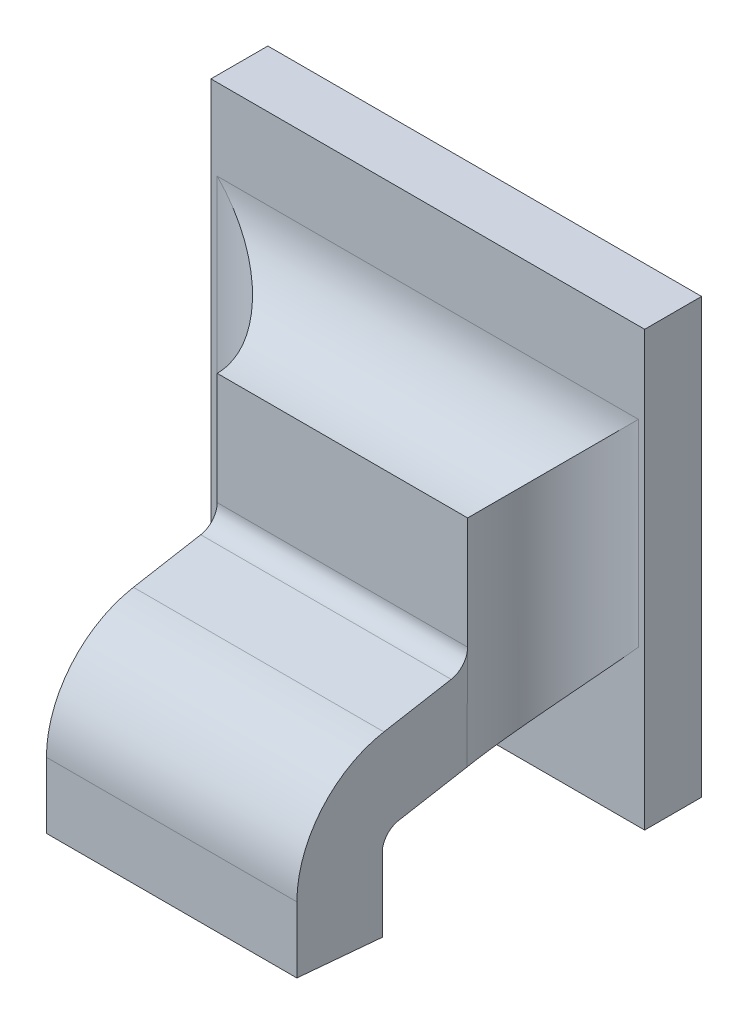
ISO-10303-21;
HEADER;
FILE_DESCRIPTION(('STEP AP214'),'2;1');
FILE_NAME('part.step','',(''),(''),'','','');
FILE_SCHEMA(('AUTOMOTIVE_DESIGN { 1 0 10303 214 1 1 1 1 }'));
ENDSEC;
DATA;
#1=APPLICATION_CONTEXT('core data for automotive mechanical design processes');
#2=APPLICATION_PROTOCOL_DEFINITION('international standard','automotive_design',2000,#1);
#3=PRODUCT_CONTEXT('',#1,'mechanical');
#4=PRODUCT('Part','Part','',(#3));
#5=PRODUCT_RELATED_PRODUCT_CATEGORY('part','',(#4));
#6=PRODUCT_DEFINITION_FORMATION('','',#4);
#7=PRODUCT_DEFINITION_CONTEXT('part definition',#1,'design');
#8=PRODUCT_DEFINITION('design','',#6,#7);
#9=PRODUCT_DEFINITION_SHAPE('','',#8);
#10=(LENGTH_UNIT() NAMED_UNIT(*) SI_UNIT(.MILLI.,.METRE.));
#11=(NAMED_UNIT(*) PLANE_ANGLE_UNIT() SI_UNIT($,.RADIAN.));
#12=(NAMED_UNIT(*) SI_UNIT($,.STERADIAN.) SOLID_ANGLE_UNIT());
#13=UNCERTAINTY_MEASURE_WITH_UNIT(LENGTH_MEASURE(1.E-05),#10,'distance_accuracy_value','');
#14=(GEOMETRIC_REPRESENTATION_CONTEXT(3) GLOBAL_UNCERTAINTY_ASSIGNED_CONTEXT((#13)) GLOBAL_UNIT_ASSIGNED_CONTEXT((#10,
#11,#12)) REPRESENTATION_CONTEXT('',''));
#15=CARTESIAN_POINT('',(0.,0.,0.));
#16=DIRECTION('',(0.,0.,1.));
#17=DIRECTION('',(1.,0.,0.));
#18=AXIS2_PLACEMENT_3D('',#15,#16,#17);
#19=CARTESIAN_POINT('',(-0.558543209453366,-0.409030625475599,0.0757120583538573));
#20=DIRECTION('',(0.,0.984807753012208,0.17364817766693));
#21=DIRECTION('',(0.,-0.17364817766693,0.984807753012208));
#22=AXIS2_PLACEMENT_3D('',#19,#20,#21);
#23=PLANE('',#22);
#24=DIRECTION('',(0.,-0.1736481776669,0.984807753012213));
#25=VECTOR('',#24,1.);
#26=CARTESIAN_POINT('',(-0.540354233075413,-0.40907165363979,0.0759447406355241));
#27=LINE('',#26,#25);
#28=CARTESIAN_POINT('',(-0.540354233075413,-0.40907165363979,0.0759447406355241));
#29=VERTEX_POINT('',#28);
#30=CARTESIAN_POINT('',(-0.540354233075413,-0.409892216923603,0.0805983862688596));
#31=VERTEX_POINT('',#30);
#32=EDGE_CURVE('E149',#29,#31,#27,.T.);
#33=ORIENTED_EDGE('',*,*,#32,.F.);
#34=DIRECTION('',(1.,0.,0.));
#35=VECTOR('',#34,1.);
#36=CARTESIAN_POINT('',(-0.53948809134313,-0.409071653639789,0.0759447406355242));
#37=LINE('',#36,#35);
#38=CARTESIAN_POINT('',(-0.557677067721083,-0.40907165363979,0.0759447406355241));
#39=VERTEX_POINT('',#38);
#40=EDGE_CURVE('E145',#29,#39,#37,.F.);
#41=ORIENTED_EDGE('',*,*,#40,.T.);
#42=DIRECTION('',(0.,-0.1736481776669,0.984807753012213));
#43=VECTOR('',#42,1.);
#44=CARTESIAN_POINT('',(-0.557677067721083,-0.40907165363979,0.0759447406355241));
#45=LINE('',#44,#43);
#46=CARTESIAN_POINT('',(-0.557677067721083,-0.409892216923603,0.0805983862688596));
#47=VERTEX_POINT('',#46);
#48=EDGE_CURVE('E187',#39,#47,#45,.T.);
#49=ORIENTED_EDGE('',*,*,#48,.T.);
#50=DIRECTION('',(1.,0.,0.));
#51=VECTOR('',#50,1.);
#52=CARTESIAN_POINT('',(-0.53948809134313,-0.409892216923603,0.0805983862688598));
#53=LINE('',#52,#51);
#54=EDGE_CURVE('E228',#31,#47,#53,.F.);
#55=ORIENTED_EDGE('',*,*,#54,.F.);
#56=EDGE_LOOP('',(#33,#41,#49,#55));
#57=FACE_BOUND('',#56,.T.);
#58=ADVANCED_FACE('F17',(#57),#23,.T.);
#59=CARTESIAN_POINT('',(-0.53948809134313,-0.417065029297904,0.0793336259197108));
#60=DIRECTION('',(1.,0.,0.));
#61=DIRECTION('',(0.,1.,0.));
#62=AXIS2_PLACEMENT_3D('',#59,#60,#61);
#63=CYLINDRICAL_SURFACE('',#62,0.00728346456692914);
#64=CARTESIAN_POINT('',(-0.540354233075413,-0.417065029297904,0.0793336259197108));
#65=DIRECTION('',(1.,0.,0.));
#66=DIRECTION('',(0.,1.,0.));
#67=AXIS2_PLACEMENT_3D('',#64,#65,#66);
#68=CIRCLE('',#67,0.00728346456692914);
#69=CARTESIAN_POINT('',(-0.540354233075413,-0.417065029297904,0.0866170904866399));
#70=VERTEX_POINT('',#69);
#71=EDGE_CURVE('E202',#31,#70,#68,.T.);
#72=ORIENTED_EDGE('',*,*,#71,.F.);
#73=ORIENTED_EDGE('',*,*,#54,.T.);
#74=CARTESIAN_POINT('',(-0.557677067721083,-0.417065029297904,0.0793336259197108));
#75=DIRECTION('',(1.,0.,0.));
#76=DIRECTION('',(0.,1.,0.));
#77=AXIS2_PLACEMENT_3D('',#74,#75,#76);
#78=CIRCLE('',#77,0.00728346456692914);
#79=CARTESIAN_POINT('',(-0.557677067721083,-0.417065029297904,0.0866170904866399));
#80=VERTEX_POINT('',#79);
#81=EDGE_CURVE('E184',#47,#80,#78,.T.);
#82=ORIENTED_EDGE('',*,*,#81,.T.);
#83=DIRECTION('',(1.,0.,0.));
#84=VECTOR('',#83,1.);
#85=CARTESIAN_POINT('',(-0.558543209453366,-0.417065029297904,0.0866170904866399));
#86=LINE('',#85,#84);
#87=EDGE_CURVE('E224',#70,#80,#86,.F.);
#88=ORIENTED_EDGE('',*,*,#87,.F.);
#89=EDGE_LOOP('',(#72,#73,#82,#88));
#90=FACE_BOUND('',#89,.T.);
#91=ADVANCED_FACE('F278',(#90),#63,.T.);
#92=CARTESIAN_POINT('',(-0.558543209453366,-0.416837019770818,0.0866170904866399));
#93=DIRECTION('',(0.,0.,1.));
#94=DIRECTION('',(0.,-1.,0.));
#95=AXIS2_PLACEMENT_3D('',#92,#93,#94);
#96=PLANE('',#95);
#97=ORIENTED_EDGE('',*,*,#87,.T.);
#98=DIRECTION('',(0.,1.,0.));
#99=VECTOR('',#98,1.);
#100=CARTESIAN_POINT('',(-0.557677067721083,-0.422863247680058,0.0866170904866399));
#101=LINE('',#100,#99);
#102=CARTESIAN_POINT('',(-0.557677067721083,-0.421625219839629,0.0866170904866399));
#103=VERTEX_POINT('',#102);
#104=EDGE_CURVE('E181',#80,#103,#101,.F.);
#105=ORIENTED_EDGE('',*,*,#104,.T.);
#106=DIRECTION('',(1.,0.,0.));
#107=VECTOR('',#106,1.);
#108=CARTESIAN_POINT('',(-0.549015650398248,-0.421625219839629,0.0866170904866399));
#109=LINE('',#108,#107);
#110=CARTESIAN_POINT('',(-0.540354233075413,-0.421625219839629,0.0866170904866399));
#111=VERTEX_POINT('',#110);
#112=EDGE_CURVE('E215',#103,#111,#109,.T.);
#113=ORIENTED_EDGE('',*,*,#112,.T.);
#114=DIRECTION('',(0.,1.,0.));
#115=VECTOR('',#114,1.);
#116=CARTESIAN_POINT('',(-0.540354233075413,-0.422863247680058,0.0866170904866399));
#117=LINE('',#116,#115);
#118=EDGE_CURVE('E200',#70,#111,#117,.F.);
#119=ORIENTED_EDGE('',*,*,#118,.F.);
#120=EDGE_LOOP('',(#97,#105,#113,#119));
#121=FACE_BOUND('',#120,.T.);
#122=ADVANCED_FACE('F282',(#121),#96,.T.);
#123=CARTESIAN_POINT('',(-0.549015650398248,-0.421657307598093,0.0862503257291207));
#124=DIRECTION('',(0.,0.99619469809174,-0.0871557427477276));
#125=DIRECTION('',(0.,0.0871557427477276,0.99619469809174));
#126=AXIS2_PLACEMENT_3D('',#123,#124,#125);
#127=PLANE('',#126);
#128=DIRECTION('',(0.,-0.0871557427476629,-0.996194698091745));
#129=VECTOR('',#128,1.);
#130=CARTESIAN_POINT('',(-0.540354233075413,-0.421625219839629,0.0866170904866399));
#131=LINE('',#130,#129);
#132=CARTESIAN_POINT('',(-0.540354233075413,-0.422141885175412,0.0807115786756163));
#133=VERTEX_POINT('',#132);
#134=EDGE_CURVE('E197',#111,#133,#131,.T.);
#135=ORIENTED_EDGE('',*,*,#134,.F.);
#136=ORIENTED_EDGE('',*,*,#112,.F.);
#137=DIRECTION('',(0.,-0.0871557427476629,-0.996194698091745));
#138=VECTOR('',#137,1.);
#139=CARTESIAN_POINT('',(-0.557677067721083,-0.421625219839629,0.0866170904866399));
#140=LINE('',#139,#138);
#141=CARTESIAN_POINT('',(-0.557677067721083,-0.422141885175412,0.0807115786756163));
#142=VERTEX_POINT('',#141);
#143=EDGE_CURVE('E178',#103,#142,#140,.T.);
#144=ORIENTED_EDGE('',*,*,#143,.T.);
#145=DIRECTION('',(1.,0.,0.));
#146=VECTOR('',#145,1.);
#147=CARTESIAN_POINT('',(-0.558543209453366,-0.422141885175412,0.0807115786756163));
#148=LINE('',#147,#146);
#149=EDGE_CURVE('E212',#142,#133,#148,.T.);
#150=ORIENTED_EDGE('',*,*,#149,.T.);
#151=EDGE_LOOP('',(#135,#136,#144,#150));
#152=FACE_BOUND('',#151,.T.);
#153=ADVANCED_FACE('F286',(#152),#127,.F.);
#154=CARTESIAN_POINT('',(-0.558543209453366,-0.416811186504029,0.0807115786756163));
#155=DIRECTION('',(0.,0.,1.));
#156=DIRECTION('',(0.,-1.,0.));
#157=AXIS2_PLACEMENT_3D('',#154,#155,#156);
#158=PLANE('',#157);
#159=ORIENTED_EDGE('',*,*,#149,.F.);
#160=DIRECTION('',(0.,1.,0.));
#161=VECTOR('',#160,1.);
#162=CARTESIAN_POINT('',(-0.557677067721083,-0.422863247680058,0.0807115786756163));
#163=LINE('',#162,#161);
#164=CARTESIAN_POINT('',(-0.557677067721083,-0.417065029297904,0.0807115786756163));
#165=VERTEX_POINT('',#164);
#166=EDGE_CURVE('E175',#142,#165,#163,.T.);
#167=ORIENTED_EDGE('',*,*,#166,.T.);
#168=DIRECTION('',(1.,0.,0.));
#169=VECTOR('',#168,1.);
#170=CARTESIAN_POINT('',(-0.53948809134313,-0.417065029297904,0.0807115786756163));
#171=LINE('',#170,#169);
#172=CARTESIAN_POINT('',(-0.540354233075413,-0.417065029297904,0.0807115786756163));
#173=VERTEX_POINT('',#172);
#174=EDGE_CURVE('E207',#165,#173,#171,.T.);
#175=ORIENTED_EDGE('',*,*,#174,.T.);
#176=DIRECTION('',(0.,1.,0.));
#177=VECTOR('',#176,1.);
#178=CARTESIAN_POINT('',(-0.540354233075413,-0.422863247680058,0.0807115786756163));
#179=LINE('',#178,#177);
#180=EDGE_CURVE('E194',#133,#173,#179,.T.);
#181=ORIENTED_EDGE('',*,*,#180,.F.);
#182=EDGE_LOOP('',(#159,#167,#175,#181));
#183=FACE_BOUND('',#182,.T.);
#184=ADVANCED_FACE('F290',(#183),#158,.F.);
#185=CARTESIAN_POINT('',(-0.53948809134313,-0.417065029297904,0.0793336259197108));
#186=DIRECTION('',(1.,0.,0.));
#187=DIRECTION('',(0.,1.,0.));
#188=AXIS2_PLACEMENT_3D('',#185,#186,#187);
#189=CYLINDRICAL_SURFACE('',#188,0.00137795275590551);
#190=DIRECTION('',(1.,0.,0.));
#191=VECTOR('',#190,1.);
#192=CARTESIAN_POINT('',(-0.558543209453366,-0.415708010740604,0.0795729049046849));
#193=LINE('',#192,#191);
#194=CARTESIAN_POINT('',(-0.557677067721083,-0.415708010740604,0.0795729049046849));
#195=VERTEX_POINT('',#194);
#196=CARTESIAN_POINT('',(-0.540354233075413,-0.415708010740604,0.0795729049046849));
#197=VERTEX_POINT('',#196);
#198=EDGE_CURVE('E191',#195,#197,#193,.T.);
#199=ORIENTED_EDGE('',*,*,#198,.T.);
#200=CARTESIAN_POINT('',(-0.540354233075413,-0.417065029297904,0.0793336259197108));
#201=DIRECTION('',(1.,0.,0.));
#202=DIRECTION('',(0.,1.,0.));
#203=AXIS2_PLACEMENT_3D('',#200,#201,#202);
#204=CIRCLE('',#203,0.00137795275590551);
#205=EDGE_CURVE('E196',#173,#197,#204,.F.);
#206=ORIENTED_EDGE('',*,*,#205,.F.);
#207=ORIENTED_EDGE('',*,*,#174,.F.);
#208=CARTESIAN_POINT('',(-0.557677067721083,-0.417065029297904,0.0793336259197108));
#209=DIRECTION('',(1.,0.,0.));
#210=DIRECTION('',(0.,1.,0.));
#211=AXIS2_PLACEMENT_3D('',#208,#209,#210);
#212=CIRCLE('',#211,0.00137795275590551);
#213=EDGE_CURVE('E172',#165,#195,#212,.F.);
#214=ORIENTED_EDGE('',*,*,#213,.T.);
#215=EDGE_LOOP('',(#199,#206,#207,#214));
#216=FACE_BOUND('',#215,.T.);
#217=ADVANCED_FACE('F294',(#216),#189,.F.);
#218=CARTESIAN_POINT('',(-0.53948809134313,-0.407714635082489,0.0761840196204982));
#219=DIRECTION('',(1.,0.,0.));
#220=DIRECTION('',(0.,1.,0.));
#221=AXIS2_PLACEMENT_3D('',#218,#219,#220);
#222=CYLINDRICAL_SURFACE('',#221,0.00137795275590552);
#223=ORIENTED_EDGE('',*,*,#40,.F.);
#224=CARTESIAN_POINT('',(-0.540354233075413,-0.407714635082489,0.0761840196204982));
#225=DIRECTION('',(1.,0.,0.));
#226=DIRECTION('',(0.,1.,0.));
#227=AXIS2_PLACEMENT_3D('',#224,#225,#226);
#228=CIRCLE('',#227,0.00137795275590552);
#229=CARTESIAN_POINT('',(-0.540354233075413,-0.407714635082489,0.0748060668645927));
#230=VERTEX_POINT('',#229);
#231=EDGE_CURVE('E20',#230,#29,#228,.F.);
#232=ORIENTED_EDGE('',*,*,#231,.F.);
#233=DIRECTION('',(1.,0.,0.));
#234=VECTOR('',#233,1.);
#235=CARTESIAN_POINT('',(-0.558543209453366,-0.407714635082489,0.0748060668645927));
#236=LINE('',#235,#234);
#237=CARTESIAN_POINT('',(-0.557677067721083,-0.407714635082489,0.0748060668645927));
#238=VERTEX_POINT('',#237);
#239=EDGE_CURVE('E127',#238,#230,#236,.T.);
#240=ORIENTED_EDGE('',*,*,#239,.F.);
#241=CARTESIAN_POINT('',(-0.557677067721083,-0.407714635082489,0.0761840196204982));
#242=DIRECTION('',(1.,0.,0.));
#243=DIRECTION('',(0.,1.,0.));
#244=AXIS2_PLACEMENT_3D('',#241,#242,#243);
#245=CIRCLE('',#244,0.00137795275590552);
#246=EDGE_CURVE('E139',#238,#39,#245,.F.);
#247=ORIENTED_EDGE('',*,*,#246,.T.);
#248=EDGE_LOOP('',(#223,#232,#240,#247));
#249=FACE_BOUND('',#248,.T.);
#250=ADVANCED_FACE('F143',(#249),#222,.F.);
#251=CARTESIAN_POINT('',(-0.540354233075413,-0.422863247680058,0.0742155156834903));
#252=DIRECTION('',(1.,0.,0.));
#253=DIRECTION('',(0.,1.,0.));
#254=AXIS2_PLACEMENT_3D('',#251,#252,#253);
#255=PLANE('',#254);
#256=ORIENTED_EDGE('',*,*,#205,.T.);
#257=DIRECTION('',(0.,-0.17364817766693,0.984807753012208));
#258=VECTOR('',#257,1.);
#259=CARTESIAN_POINT('',(-0.540354233075413,-0.4148464192926,0.0746865769896825));
#260=LINE('',#259,#258);
#261=CARTESIAN_POINT('',(-0.540354233075413,-0.414877006254794,0.074862663067971));
#262=VERTEX_POINT('',#261);
#263=EDGE_CURVE('E162',#197,#262,#260,.F.);
#264=ORIENTED_EDGE('',*,*,#263,.T.);
#265=DIRECTION('',(0.,1.,0.));
#266=VECTOR('',#265,1.);
#267=CARTESIAN_POINT('',(-0.540354233075414,-0.393026144704955,0.0748060668645927));
#268=LINE('',#267,#266);
#269=EDGE_CURVE('E138',#262,#230,#268,.T.);
#270=ORIENTED_EDGE('',*,*,#269,.T.);
#271=ORIENTED_EDGE('',*,*,#231,.T.);
#272=ORIENTED_EDGE('',*,*,#32,.T.);
#273=ORIENTED_EDGE('',*,*,#71,.T.);
#274=ORIENTED_EDGE('',*,*,#118,.T.);
#275=ORIENTED_EDGE('',*,*,#134,.T.);
#276=ORIENTED_EDGE('',*,*,#180,.T.);
#277=EDGE_LOOP('',(#256,#264,#270,#271,#272,#273,#274,#275,#276));
#278=FACE_BOUND('',#277,.T.);
#279=ADVANCED_FACE('F160',(#278),#255,.T.);
#280=CARTESIAN_POINT('',(-0.558543209453366,-0.4148464192926,0.0746865769896825));
#281=DIRECTION('',(0.,0.984807753012208,0.17364817766693));
#282=DIRECTION('',(0.,-0.17364817766693,0.984807753012208));
#283=AXIS2_PLACEMENT_3D('',#280,#281,#282);
#284=PLANE('',#283);
#285=DIRECTION('',(1.,0.,0.));
#286=VECTOR('',#285,1.);
#287=CARTESIAN_POINT('',(-0.532992028351004,-0.414887447456791,0.0749192592713494));
#288=LINE('',#287,#286);
#289=CARTESIAN_POINT('',(-0.557677067721083,-0.414877006254794,0.074862663067971));
#290=VERTEX_POINT('',#289);
#291=EDGE_CURVE('E243',#262,#290,#288,.F.);
#292=ORIENTED_EDGE('',*,*,#291,.F.);
#293=ORIENTED_EDGE('',*,*,#263,.F.);
#294=ORIENTED_EDGE('',*,*,#198,.F.);
#295=DIRECTION('',(0.,0.173648177666878,-0.984807753012217));
#296=VECTOR('',#295,1.);
#297=CARTESIAN_POINT('',(-0.557677067721083,-0.415708010740604,0.0795729049046849));
#298=LINE('',#297,#296);
#299=EDGE_CURVE('E169',#195,#290,#298,.T.);
#300=ORIENTED_EDGE('',*,*,#299,.T.);
#301=EDGE_LOOP('',(#292,#293,#294,#300));
#302=FACE_BOUND('',#301,.T.);
#303=ADVANCED_FACE('F297',(#302),#284,.F.);
#304=CARTESIAN_POINT('',(-0.557677067721083,-0.422863247680058,0.0742155156834903));
#305=DIRECTION('',(1.,0.,0.));
#306=DIRECTION('',(0.,1.,0.));
#307=AXIS2_PLACEMENT_3D('',#304,#305,#306);
#308=PLANE('',#307);
#309=DIRECTION('',(0.,-1.,0.));
#310=VECTOR('',#309,1.);
#311=CARTESIAN_POINT('',(-0.557677067721082,-0.449184274957739,0.0748060668645927));
#312=LINE('',#311,#310);
#313=EDGE_CURVE('E239',#238,#290,#312,.T.);
#314=ORIENTED_EDGE('',*,*,#313,.T.);
#315=ORIENTED_EDGE('',*,*,#299,.F.);
#316=ORIENTED_EDGE('',*,*,#213,.F.);
#317=ORIENTED_EDGE('',*,*,#166,.F.);
#318=ORIENTED_EDGE('',*,*,#143,.F.);
#319=ORIENTED_EDGE('',*,*,#104,.F.);
#320=ORIENTED_EDGE('',*,*,#81,.F.);
#321=ORIENTED_EDGE('',*,*,#48,.F.);
#322=ORIENTED_EDGE('',*,*,#246,.F.);
#323=EDGE_LOOP('',(#314,#315,#316,#317,#318,#319,#320,#321,#322));
#324=FACE_BOUND('',#323,.T.);
#325=ADVANCED_FACE('F300',(#324),#308,.F.);
#326=CARTESIAN_POINT('',(-0.558543209453366,-0.399584528605045,0.0748060668645927));
#327=DIRECTION('',(0.,0.,1.));
#328=DIRECTION('',(0.,-1.,0.));
#329=AXIS2_PLACEMENT_3D('',#326,#327,#328);
#330=PLANE('',#329);
#331=DIRECTION('',(0.,1.,0.));
#332=VECTOR('',#331,1.);
#333=CARTESIAN_POINT('',(-0.540354233075414,-0.393026144704955,0.0748060668645927));
#334=LINE('',#333,#332);
#335=CARTESIAN_POINT('',(-0.540354233075414,-0.399971676532543,0.0748060668645927));
#336=VERTEX_POINT('',#335);
#337=EDGE_CURVE('E132',#230,#336,#334,.T.);
#338=ORIENTED_EDGE('',*,*,#337,.T.);
#339=DIRECTION('',(-1.,0.,0.));
#340=VECTOR('',#339,1.);
#341=CARTESIAN_POINT('',(-0.565039272445492,-0.399971676532543,0.0748060668645927));
#342=LINE('',#341,#340);
#343=CARTESIAN_POINT('',(-0.557677067721082,-0.399971676532543,0.0748060668645927));
#344=VERTEX_POINT('',#343);
#345=EDGE_CURVE('E237',#336,#344,#342,.T.);
#346=ORIENTED_EDGE('',*,*,#345,.T.);
#347=DIRECTION('',(0.,-1.,0.));
#348=VECTOR('',#347,1.);
#349=CARTESIAN_POINT('',(-0.557677067721082,-0.449184274957739,0.0748060668645927));
#350=LINE('',#349,#348);
#351=EDGE_CURVE('E134',#344,#238,#350,.T.);
#352=ORIENTED_EDGE('',*,*,#351,.T.);
#353=ORIENTED_EDGE('',*,*,#239,.T.);
#354=EDGE_LOOP('',(#338,#346,#352,#353));
#355=FACE_BOUND('',#354,.T.);
#356=ADVANCED_FACE('F129',(#355),#330,.T.);
#357=CARTESIAN_POINT('',(-0.53444872126439,-0.393026144704955,0.0748060668645927));
#358=DIRECTION('',(0.,1.,0.));
#359=DIRECTION('',(-1.,0.,0.));
#360=AXIS2_PLACEMENT_3D('',#357,#358,#359);
#361=CYLINDRICAL_SURFACE('',#360,0.00590551181102362);
#362=DIRECTION('',(0.,-1.,0.));
#363=VECTOR('',#362,1.);
#364=CARTESIAN_POINT('',(-0.53444872126439,-0.386955627617741,0.068900555053569));
#365=LINE('',#364,#363);
#366=CARTESIAN_POINT('',(-0.53444872126439,-0.394066164721519,0.068900555053569));
#367=VERTEX_POINT('',#366);
#368=CARTESIAN_POINT('',(-0.53444872126439,-0.407714635082489,0.068900555053569));
#369=VERTEX_POINT('',#368);
#370=EDGE_CURVE('E236',#367,#369,#365,.T.);
#371=ORIENTED_EDGE('',*,*,#370,.F.);
#372=CARTESIAN_POINT('',(-0.53444872126439,-0.394066164721519,0.0748060668645927));
#373=DIRECTION('',(-0.707106781186547,0.707106781186548,0.));
#374=DIRECTION('',(0.707106781186548,0.707106781186547,0.));
#375=AXIS2_PLACEMENT_3D('',#372,#373,#374);
#376=ELLIPSE('',#375,0.0083516548959041,0.00590551181102362);
#377=EDGE_CURVE('E156',#367,#336,#376,.T.);
#378=ORIENTED_EDGE('',*,*,#377,.T.);
#379=ORIENTED_EDGE('',*,*,#337,.F.);
#380=ORIENTED_EDGE('',*,*,#269,.F.);
#381=CARTESIAN_POINT('',(-0.540353962296412,-0.414877229399998,0.0748626193057814));
#382=CARTESIAN_POINT('',(-0.540357183095312,-0.414822345358043,0.0745625907676648));
#383=CARTESIAN_POINT('',(-0.540336844976014,-0.414747912523892,0.0742670861215287));
#384=CARTESIAN_POINT('',(-0.540255812362433,-0.414566029192177,0.0736951202756243));
#385=CARTESIAN_POINT('',(-0.540195495871341,-0.414458892981912,0.0734185072209176));
#386=CARTESIAN_POINT('',(-0.540041411494878,-0.414216970584898,0.0728895664132635));
#387=CARTESIAN_POINT('',(-0.539947784765884,-0.414082302078734,0.0726371418024798));
#388=CARTESIAN_POINT('',(-0.539733537171896,-0.413790403393458,0.0721575004164845));
#389=CARTESIAN_POINT('',(-0.539612847412104,-0.413633116006272,0.0719303502308829));
#390=CARTESIAN_POINT('',(-0.539282498700709,-0.413215165967727,0.0713921813150784));
#391=CARTESIAN_POINT('',(-0.539059088120156,-0.41294307698677,0.0710984599177277));
#392=CARTESIAN_POINT('',(-0.53857931096424,-0.412371662479598,0.0705703773106215));
#393=CARTESIAN_POINT('',(-0.538322868304569,-0.412072274554655,0.0703361569747717));
#394=CARTESIAN_POINT('',(-0.537687361446135,-0.41133940549552,0.0698459866782061));
#395=CARTESIAN_POINT('',(-0.53729844120996,-0.410897824870701,0.0696149681298131));
#396=CARTESIAN_POINT('',(-0.536498466905959,-0.409996799769943,0.0692502815851391));
#397=CARTESIAN_POINT('',(-0.536087428340085,-0.409537367866513,0.0691165463367526));
#398=CARTESIAN_POINT('',(-0.535386044489259,-0.408755994596217,0.0689681308468836));
#399=CARTESIAN_POINT('',(-0.535098271095166,-0.408436116517512,0.0689292677247087));
#400=CARTESIAN_POINT('',(-0.534689561870272,-0.407982102078162,0.0689042416244373));
#401=CARTESIAN_POINT('',(-0.534569134258578,-0.407848360835383,0.0689005652100869));
#402=CARTESIAN_POINT('',(-0.53444872126439,-0.407714635082489,0.0689005550535691));
#403=B_SPLINE_CURVE_WITH_KNOTS('',3,(#381,#382,#383,#384,#385,#386,#387,#388,#389,#390,#391,
#392,#393,#394,#395,#396,#397,#398,#399,#400,#401,#402),.UNSPECIFIED.,.F.,.F.,(4,2,2,2,2,2,2,2,
2,2,4),(0.,0.000911854640629294,0.00181520821824951,0.00271477844400075,0.00361666525652744,
0.00498448467541975,0.00635551296143177,0.00824194679715815,0.0101270752955224,
0.0114210586750924,0.0119609297477214),.UNSPECIFIED.);
#404=EDGE_CURVE('E157',#369,#262,#403,.F.);
#405=ORIENTED_EDGE('',*,*,#404,.F.);
#406=EDGE_LOOP('',(#371,#378,#379,#380,#405));
#407=FACE_BOUND('',#406,.T.);
#408=ADVANCED_FACE('F153',(#407),#361,.F.);
#409=CARTESIAN_POINT('',(-0.532992028351004,-0.407714635082489,0.0761840196204982));
#410=DIRECTION('',(1.,0.,0.));
#411=DIRECTION('',(0.,1.,0.));
#412=AXIS2_PLACEMENT_3D('',#409,#410,#411);
#413=CYLINDRICAL_SURFACE('',#412,0.00728346456692914);
#414=ORIENTED_EDGE('',*,*,#404,.T.);
#415=ORIENTED_EDGE('',*,*,#291,.T.);
#416=CARTESIAN_POINT('',(-0.557677338500084,-0.414877229399998,0.0748626193057814));
#417=CARTESIAN_POINT('',(-0.557674117701183,-0.414822345358043,0.0745625907676648));
#418=CARTESIAN_POINT('',(-0.557694455820482,-0.414747912523892,0.0742670861215288));
#419=CARTESIAN_POINT('',(-0.557775488434063,-0.414566029192177,0.0736951202756243));
#420=CARTESIAN_POINT('',(-0.557835804925155,-0.414458892981912,0.0734185072209176));
#421=CARTESIAN_POINT('',(-0.557989889301618,-0.414216970584898,0.0728895664132635));
#422=CARTESIAN_POINT('',(-0.558083516030611,-0.414082302078734,0.0726371418024798));
#423=CARTESIAN_POINT('',(-0.5582977636246,-0.413790403393458,0.0721575004164846));
#424=CARTESIAN_POINT('',(-0.558418453384392,-0.413633116006272,0.0719303502308829));
#425=CARTESIAN_POINT('',(-0.558748802095787,-0.413215165967727,0.0713921813150784));
#426=CARTESIAN_POINT('',(-0.55897221267634,-0.41294307698677,0.0710984599177277));
#427=CARTESIAN_POINT('',(-0.559451989832256,-0.412371662479598,0.0705703773106215));
#428=CARTESIAN_POINT('',(-0.559708432491927,-0.412072274554655,0.0703361569747717));
#429=CARTESIAN_POINT('',(-0.560343939350361,-0.41133940549552,0.0698459866782061));
#430=CARTESIAN_POINT('',(-0.560732859586536,-0.410897824870701,0.0696149681298131));
#431=CARTESIAN_POINT('',(-0.561532833890537,-0.409996799769943,0.0692502815851391));
#432=CARTESIAN_POINT('',(-0.561943872456411,-0.409537367866513,0.0691165463367526));
#433=CARTESIAN_POINT('',(-0.562645256307237,-0.408755994596217,0.0689681308468836));
#434=CARTESIAN_POINT('',(-0.562933029701331,-0.408436116517513,0.0689292677247087));
#435=CARTESIAN_POINT('',(-0.563341738926224,-0.407982102078163,0.0689042416244373));
#436=CARTESIAN_POINT('',(-0.563462166537918,-0.407848360835383,0.0689005652100869));
#437=CARTESIAN_POINT('',(-0.563582579532106,-0.407714635082489,0.0689005550535691));
#438=B_SPLINE_CURVE_WITH_KNOTS('',3,(#416,#417,#418,#419,#420,#421,#422,#423,#424,#425,#426,
#427,#428,#429,#430,#431,#432,#433,#434,#435,#436,#437),.UNSPECIFIED.,.F.,.F.,(4,2,2,2,2,2,2,2,
2,2,4),(0.,0.000911854640629268,0.00181520821824951,0.00271477844400076,0.00361666525652745,
0.00498448467541976,0.00635551296143178,0.00824194679715816,0.0101270752955224,
0.0114210586750924,0.0119609297477214),.UNSPECIFIED.);
#439=CARTESIAN_POINT('',(-0.563582579532106,-0.407714635082489,0.068900555053569));
#440=VERTEX_POINT('',#439);
#441=EDGE_CURVE('E240',#290,#440,#438,.T.);
#442=ORIENTED_EDGE('',*,*,#441,.T.);
#443=DIRECTION('',(1.,0.,0.));
#444=VECTOR('',#443,1.);
#445=CARTESIAN_POINT('',(-0.565515650398248,-0.407714635082489,0.068900555053569));
#446=LINE('',#445,#444);
#447=EDGE_CURVE('E310',#369,#440,#446,.F.);
#448=ORIENTED_EDGE('',*,*,#447,.F.);
#449=EDGE_LOOP('',(#414,#415,#442,#448));
#450=FACE_BOUND('',#449,.T.);
#451=ADVANCED_FACE('F255',(#450),#413,.T.);
#452=CARTESIAN_POINT('',(-0.563582579532106,-0.449184274957739,0.0748060668645927));
#453=DIRECTION('',(0.,-1.,0.));
#454=DIRECTION('',(1.,0.,0.));
#455=AXIS2_PLACEMENT_3D('',#452,#453,#454);
#456=CYLINDRICAL_SURFACE('',#455,0.00590551181102362);
#457=ORIENTED_EDGE('',*,*,#351,.F.);
#458=CARTESIAN_POINT('',(-0.563582579532106,-0.394066164721519,0.0748060668645927));
#459=DIRECTION('',(-0.707106781186548,-0.707106781186547,0.));
#460=DIRECTION('',(0.707106781186547,-0.707106781186548,0.));
#461=AXIS2_PLACEMENT_3D('',#458,#459,#460);
#462=ELLIPSE('',#461,0.0083516548959041,0.00590551181102362);
#463=CARTESIAN_POINT('',(-0.563582579532106,-0.394066164721519,0.068900555053569));
#464=VERTEX_POINT('',#463);
#465=EDGE_CURVE('E233',#344,#464,#462,.F.);
#466=ORIENTED_EDGE('',*,*,#465,.T.);
#467=DIRECTION('',(0.,-1.,0.));
#468=VECTOR('',#467,1.);
#469=CARTESIAN_POINT('',(-0.563582579532106,-0.386955627617741,0.068900555053569));
#470=LINE('',#469,#468);
#471=EDGE_CURVE('E312',#440,#464,#470,.F.);
#472=ORIENTED_EDGE('',*,*,#471,.F.);
#473=ORIENTED_EDGE('',*,*,#441,.F.);
#474=ORIENTED_EDGE('',*,*,#313,.F.);
#475=EDGE_LOOP('',(#457,#466,#472,#473,#474));
#476=FACE_BOUND('',#475,.T.);
#477=ADVANCED_FACE('F252',(#476),#456,.F.);
#478=CARTESIAN_POINT('',(-0.565039272445492,-0.394066164721519,0.0748060668645927));
#479=DIRECTION('',(-1.,0.,0.));
#480=DIRECTION('',(0.,-1.,0.));
#481=AXIS2_PLACEMENT_3D('',#478,#479,#480);
#482=CYLINDRICAL_SURFACE('',#481,0.00590551181102362);
#483=ORIENTED_EDGE('',*,*,#345,.F.);
#484=ORIENTED_EDGE('',*,*,#377,.F.);
#485=DIRECTION('',(1.,0.,0.));
#486=VECTOR('',#485,1.);
#487=CARTESIAN_POINT('',(-0.565515650398248,-0.394066164721519,0.068900555053569));
#488=LINE('',#487,#486);
#489=EDGE_CURVE('E320',#464,#367,#488,.T.);
#490=ORIENTED_EDGE('',*,*,#489,.F.);
#491=ORIENTED_EDGE('',*,*,#465,.F.);
#492=EDGE_LOOP('',(#483,#484,#490,#491));
#493=FACE_BOUND('',#492,.T.);
#494=ADVANCED_FACE('F382',(#493),#482,.F.);
#495=CARTESIAN_POINT('',(-0.565515650398248,-0.386955627617741,0.068900555053569));
#496=DIRECTION('',(0.,0.,1.));
#497=DIRECTION('',(0.,-1.,0.));
#498=AXIS2_PLACEMENT_3D('',#495,#496,#497);
#499=PLANE('',#498);
#500=ORIENTED_EDGE('',*,*,#471,.T.);
#501=ORIENTED_EDGE('',*,*,#489,.T.);
#502=ORIENTED_EDGE('',*,*,#370,.T.);
#503=ORIENTED_EDGE('',*,*,#447,.T.);
#504=EDGE_LOOP('',(#500,#501,#502,#503));
#505=FACE_BOUND('',#504,.T.);
#506=DIRECTION('',(0.,-1.,0.));
#507=VECTOR('',#506,1.);
#508=CARTESIAN_POINT('',(-0.534015650398248,-0.386955627617741,0.068900555053569));
#509=LINE('',#508,#507);
#510=CARTESIAN_POINT('',(-0.534015650398248,-0.418455627617741,0.068900555053569));
#511=VERTEX_POINT('',#510);
#512=CARTESIAN_POINT('',(-0.534015650398248,-0.388455627617741,0.068900555053569));
#513=VERTEX_POINT('',#512);
#514=EDGE_CURVE('E332',#511,#513,#509,.F.);
#515=ORIENTED_EDGE('',*,*,#514,.T.);
#516=DIRECTION('',(1.,0.,0.));
#517=VECTOR('',#516,1.);
#518=CARTESIAN_POINT('',(-0.565515650398248,-0.388455627617741,0.068900555053569));
#519=LINE('',#518,#517);
#520=CARTESIAN_POINT('',(-0.564015650398248,-0.388455627617741,0.068900555053569));
#521=VERTEX_POINT('',#520);
#522=EDGE_CURVE('E337',#513,#521,#519,.F.);
#523=ORIENTED_EDGE('',*,*,#522,.T.);
#524=DIRECTION('',(0.,1.,0.));
#525=VECTOR('',#524,1.);
#526=CARTESIAN_POINT('',(-0.564015650398248,-0.419955627617741,0.068900555053569));
#527=LINE('',#526,#525);
#528=CARTESIAN_POINT('',(-0.564015650398248,-0.418455627617741,0.068900555053569));
#529=VERTEX_POINT('',#528);
#530=EDGE_CURVE('E340',#521,#529,#527,.F.);
#531=ORIENTED_EDGE('',*,*,#530,.T.);
#532=DIRECTION('',(-1.,0.,0.));
#533=VECTOR('',#532,1.);
#534=CARTESIAN_POINT('',(-0.532515650398248,-0.418455627617741,0.068900555053569));
#535=LINE('',#534,#533);
#536=EDGE_CURVE('E324',#529,#511,#535,.F.);
#537=ORIENTED_EDGE('',*,*,#536,.T.);
#538=EDGE_LOOP('',(#515,#523,#531,#537));
#539=FACE_BOUND('',#538,.T.);
#540=ADVANCED_FACE('F317',(#505,#539),#499,.T.);
#541=CARTESIAN_POINT('',(-0.532515650398248,-0.418455627617741,0.0647666967858525));
#542=DIRECTION('',(0.,1.,0.));
#543=DIRECTION('',(-1.,0.,0.));
#544=AXIS2_PLACEMENT_3D('',#541,#542,#543);
#545=PLANE('',#544);
#546=DIRECTION('',(0.,0.,1.));
#547=VECTOR('',#546,1.);
#548=CARTESIAN_POINT('',(-0.534015650398248,-0.418455627617741,0.0647666967858525));
#549=LINE('',#548,#547);
#550=CARTESIAN_POINT('',(-0.534015650398248,-0.418455627617741,0.0649635471795533));
#551=VERTEX_POINT('',#550);
#552=EDGE_CURVE('E325',#551,#511,#549,.T.);
#553=ORIENTED_EDGE('',*,*,#552,.T.);
#554=ORIENTED_EDGE('',*,*,#536,.F.);
#555=DIRECTION('',(0.,0.,1.));
#556=VECTOR('',#555,1.);
#557=CARTESIAN_POINT('',(-0.564015650398248,-0.418455627617741,0.0647666967858525));
#558=LINE('',#557,#556);
#559=CARTESIAN_POINT('',(-0.564015650398248,-0.418455627617741,0.0649635471795533));
#560=VERTEX_POINT('',#559);
#561=EDGE_CURVE('E343',#529,#560,#558,.F.);
#562=ORIENTED_EDGE('',*,*,#561,.T.);
#563=DIRECTION('',(1.,0.,0.));
#564=VECTOR('',#563,1.);
#565=CARTESIAN_POINT('',(-0.565515650398248,-0.418455627617741,0.0649635471795533));
#566=LINE('',#565,#564);
#567=EDGE_CURVE('E346',#560,#551,#566,.T.);
#568=ORIENTED_EDGE('',*,*,#567,.T.);
#569=EDGE_LOOP('',(#553,#554,#562,#568));
#570=FACE_BOUND('',#569,.T.);
#571=ADVANCED_FACE('F364',(#570),#545,.F.);
#572=CARTESIAN_POINT('',(-0.534015650398248,-0.386955627617741,0.0647666967858525));
#573=DIRECTION('',(-1.,0.,0.));
#574=DIRECTION('',(0.,-1.,0.));
#575=AXIS2_PLACEMENT_3D('',#572,#573,#574);
#576=PLANE('',#575);
#577=DIRECTION('',(0.,0.,1.));
#578=VECTOR('',#577,1.);
#579=CARTESIAN_POINT('',(-0.534015650398248,-0.388455627617741,0.0647666967858525));
#580=LINE('',#579,#578);
#581=CARTESIAN_POINT('',(-0.534015650398248,-0.388455627617741,0.0649635471795533));
#582=VERTEX_POINT('',#581);
#583=EDGE_CURVE('E334',#582,#513,#580,.T.);
#584=ORIENTED_EDGE('',*,*,#583,.T.);
#585=ORIENTED_EDGE('',*,*,#514,.F.);
#586=ORIENTED_EDGE('',*,*,#552,.F.);
#587=DIRECTION('',(0.,-1.,0.));
#588=VECTOR('',#587,1.);
#589=CARTESIAN_POINT('',(-0.534015650398248,-0.386955627617741,0.0649635471795533));
#590=LINE('',#589,#588);
#591=EDGE_CURVE('E349',#551,#582,#590,.F.);
#592=ORIENTED_EDGE('',*,*,#591,.T.);
#593=EDGE_LOOP('',(#584,#585,#586,#592));
#594=FACE_BOUND('',#593,.T.);
#595=ADVANCED_FACE('F361',(#594),#576,.F.);
#596=CARTESIAN_POINT('',(-0.565515650398248,-0.388455627617741,0.0647666967858525));
#597=DIRECTION('',(0.,-1.,0.));
#598=DIRECTION('',(1.,0.,0.));
#599=AXIS2_PLACEMENT_3D('',#596,#597,#598);
#600=PLANE('',#599);
#601=DIRECTION('',(0.,0.,1.));
#602=VECTOR('',#601,1.);
#603=CARTESIAN_POINT('',(-0.564015650398248,-0.388455627617741,0.0647666967858525));
#604=LINE('',#603,#602);
#605=CARTESIAN_POINT('',(-0.564015650398248,-0.388455627617741,0.0649635471795533));
#606=VERTEX_POINT('',#605);
#607=EDGE_CURVE('E34',#606,#521,#604,.T.);
#608=ORIENTED_EDGE('',*,*,#607,.T.);
#609=ORIENTED_EDGE('',*,*,#522,.F.);
#610=ORIENTED_EDGE('',*,*,#583,.F.);
#611=DIRECTION('',(1.,0.,0.));
#612=VECTOR('',#611,1.);
#613=CARTESIAN_POINT('',(-0.565515650398248,-0.388455627617741,0.0649635471795533));
#614=LINE('',#613,#612);
#615=EDGE_CURVE('E26',#582,#606,#614,.F.);
#616=ORIENTED_EDGE('',*,*,#615,.T.);
#617=EDGE_LOOP('',(#608,#609,#610,#616));
#618=FACE_BOUND('',#617,.T.);
#619=ADVANCED_FACE('F355',(#618),#600,.F.);
#620=CARTESIAN_POINT('',(-0.564015650398248,-0.419955627617741,0.0647666967858525));
#621=DIRECTION('',(1.,0.,0.));
#622=DIRECTION('',(0.,1.,0.));
#623=AXIS2_PLACEMENT_3D('',#620,#621,#622);
#624=PLANE('',#623);
#625=ORIENTED_EDGE('',*,*,#561,.F.);
#626=ORIENTED_EDGE('',*,*,#530,.F.);
#627=ORIENTED_EDGE('',*,*,#607,.F.);
#628=DIRECTION('',(0.,-1.,0.));
#629=VECTOR('',#628,1.);
#630=CARTESIAN_POINT('',(-0.564015650398248,-0.386955627617741,0.0649635471795533));
#631=LINE('',#630,#629);
#632=EDGE_CURVE('E11',#606,#560,#631,.T.);
#633=ORIENTED_EDGE('',*,*,#632,.T.);
#634=EDGE_LOOP('',(#625,#626,#627,#633));
#635=FACE_BOUND('',#634,.T.);
#636=ADVANCED_FACE('F366',(#635),#624,.F.);
#637=CARTESIAN_POINT('',(-0.565515650398248,-0.386955627617741,0.0649635471795533));
#638=DIRECTION('',(0.,0.,1.));
#639=DIRECTION('',(0.,-1.,0.));
#640=AXIS2_PLACEMENT_3D('',#637,#638,#639);
#641=PLANE('',#640);
#642=ORIENTED_EDGE('',*,*,#615,.F.);
#643=ORIENTED_EDGE('',*,*,#591,.F.);
#644=ORIENTED_EDGE('',*,*,#567,.F.);
#645=ORIENTED_EDGE('',*,*,#632,.F.);
#646=EDGE_LOOP('',(#642,#643,#644,#645));
#647=FACE_BOUND('',#646,.T.);
#648=ADVANCED_FACE('F359',(#647),#641,.F.);
#649=CLOSED_SHELL('',(#58,#91,#122,#153,#184,#217,#250,#279,#303,#325,#356,#408,#451,#477,#494,
#540,#571,#595,#619,#636,#648));
#650=MANIFOLD_SOLID_BREP('B1',#649);
#651=ADVANCED_BREP_SHAPE_REPRESENTATION('',(#18,#650),#14);
#652=SHAPE_DEFINITION_REPRESENTATION(#9,#651);
ENDSEC;
END-ISO-10303-21;
